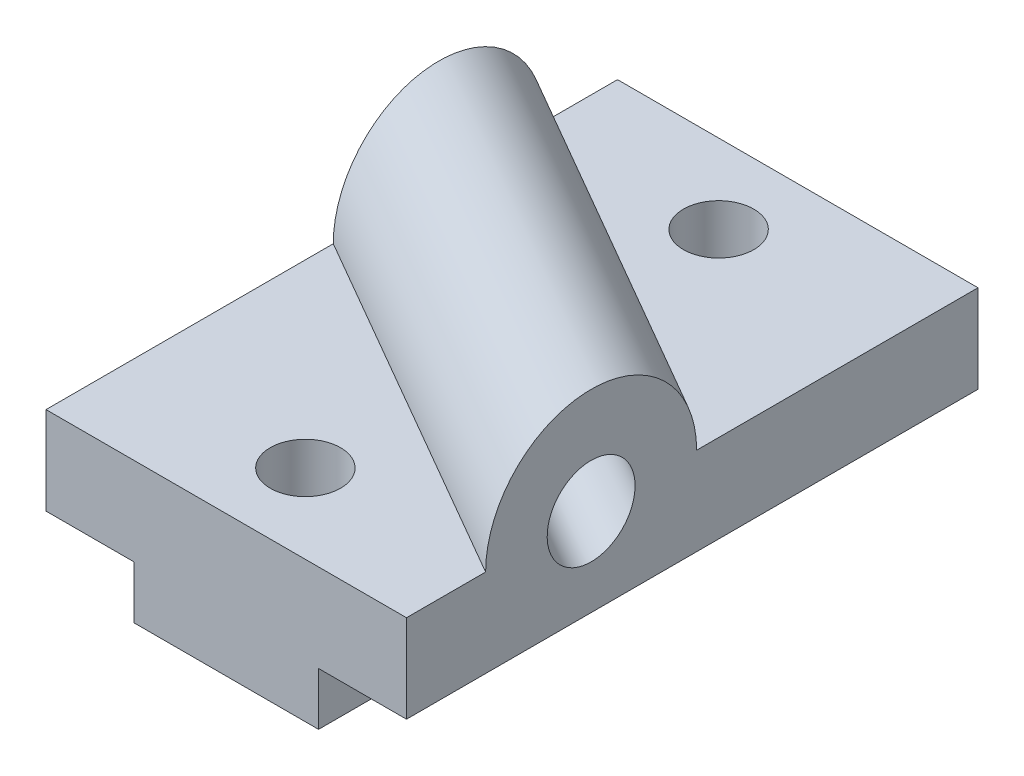
ISO-10303-21;
HEADER;
FILE_DESCRIPTION(('STEP AP214'),'2;1');
FILE_NAME('part.step','',(''),(''),'','','');
FILE_SCHEMA(('AUTOMOTIVE_DESIGN { 1 0 10303 214 1 1 1 1 }'));
ENDSEC;
DATA;
#1=APPLICATION_CONTEXT('core data for automotive mechanical design processes');
#2=APPLICATION_PROTOCOL_DEFINITION('international standard','automotive_design',2000,#1);
#3=PRODUCT_CONTEXT('',#1,'mechanical');
#4=PRODUCT('Part','Part','',(#3));
#5=PRODUCT_RELATED_PRODUCT_CATEGORY('part','',(#4));
#6=PRODUCT_DEFINITION_FORMATION('','',#4);
#7=PRODUCT_DEFINITION_CONTEXT('part definition',#1,'design');
#8=PRODUCT_DEFINITION('design','',#6,#7);
#9=PRODUCT_DEFINITION_SHAPE('','',#8);
#10=(LENGTH_UNIT() NAMED_UNIT(*) SI_UNIT(.MILLI.,.METRE.));
#11=(NAMED_UNIT(*) PLANE_ANGLE_UNIT() SI_UNIT($,.RADIAN.));
#12=(NAMED_UNIT(*) SI_UNIT($,.STERADIAN.) SOLID_ANGLE_UNIT());
#13=UNCERTAINTY_MEASURE_WITH_UNIT(LENGTH_MEASURE(1.E-05),#10,'distance_accuracy_value','');
#14=(GEOMETRIC_REPRESENTATION_CONTEXT(3) GLOBAL_UNCERTAINTY_ASSIGNED_CONTEXT((#13)) GLOBAL_UNIT_ASSIGNED_CONTEXT((#10,
#11,#12)) REPRESENTATION_CONTEXT('',''));
#15=CARTESIAN_POINT('',(0.,0.,0.));
#16=DIRECTION('',(0.,0.,1.));
#17=DIRECTION('',(1.,0.,0.));
#18=AXIS2_PLACEMENT_3D('',#15,#16,#17);
#19=CARTESIAN_POINT('',(-15.875,25.4,51.59375));
#20=DIRECTION('',(0.,-1.,0.));
#21=DIRECTION('',(1.,0.,0.));
#22=AXIS2_PLACEMENT_3D('',#19,#20,#21);
#23=PLANE('',#22);
#24=CARTESIAN_POINT('',(16.66875,25.4,37.30625));
#25=DIRECTION('',(0.,1.,0.));
#26=DIRECTION('',(-1.,0.,0.));
#27=AXIS2_PLACEMENT_3D('',#24,#25,#26);
#28=CIRCLE('',#27,6.35000000000001);
#29=CARTESIAN_POINT('',(10.31875,25.4,37.30625));
#30=VERTEX_POINT('',#29);
#31=EDGE_CURVE('E274',#30,#30,#28,.T.);
#32=ORIENTED_EDGE('',*,*,#31,.F.);
#33=EDGE_LOOP('',(#32));
#34=FACE_BOUND('',#33,.T.);
#35=DIRECTION('',(0.86602540378444,0.,0.499999999999998));
#36=VECTOR('',#35,1.);
#37=CARTESIAN_POINT('',(-55.6186306719983,25.4,-23.2180315129307));
#38=LINE('',#37,#36);
#39=CARTESIAN_POINT('',(-15.875,25.4,-0.27203564587952));
#40=VERTEX_POINT('',#39);
#41=CARTESIAN_POINT('',(49.2125,25.4,37.30625));
#42=VERTEX_POINT('',#41);
#43=EDGE_CURVE('E134',#40,#42,#38,.T.);
#44=ORIENTED_EDGE('',*,*,#43,.F.);
#45=DIRECTION('',(0.,0.,-1.));
#46=VECTOR('',#45,1.);
#47=CARTESIAN_POINT('',(-15.875,25.4,51.59375));
#48=LINE('',#47,#46);
#49=CARTESIAN_POINT('',(-15.875,25.4,51.59375));
#50=VERTEX_POINT('',#49);
#51=EDGE_CURVE('E132',#50,#40,#48,.T.);
#52=ORIENTED_EDGE('',*,*,#51,.F.);
#53=DIRECTION('',(-1.,0.,0.));
#54=VECTOR('',#53,1.);
#55=CARTESIAN_POINT('',(-15.875,25.4,51.59375));
#56=LINE('',#55,#54);
#57=CARTESIAN_POINT('',(49.2125,25.4,51.59375));
#58=VERTEX_POINT('',#57);
#59=EDGE_CURVE('E118',#58,#50,#56,.T.);
#60=ORIENTED_EDGE('',*,*,#59,.F.);
#61=DIRECTION('',(0.,0.,-1.));
#62=VECTOR('',#61,1.);
#63=CARTESIAN_POINT('',(49.2125,25.4,51.59375));
#64=LINE('',#63,#62);
#65=EDGE_CURVE('E168',#58,#42,#64,.T.);
#66=ORIENTED_EDGE('',*,*,#65,.T.);
#67=EDGE_LOOP('',(#44,#52,#60,#66));
#68=FACE_BOUND('',#67,.T.);
#69=ADVANCED_FACE('F33',(#34,#68),#23,.F.);
#70=CARTESIAN_POINT('',(16.66875,25.4,-37.30625));
#71=DIRECTION('',(0.,1.,0.));
#72=DIRECTION('',(-1.,0.,0.));
#73=AXIS2_PLACEMENT_3D('',#70,#71,#72);
#74=CIRCLE('',#73,6.35);
#75=CARTESIAN_POINT('',(10.31875,25.4,-37.30625));
#76=VERTEX_POINT('',#75);
#77=EDGE_CURVE('E271',#76,#76,#74,.T.);
#78=ORIENTED_EDGE('',*,*,#77,.F.);
#79=EDGE_LOOP('',(#78));
#80=FACE_BOUND('',#79,.T.);
#81=DIRECTION('',(0.86602540378444,0.,0.499999999999998));
#82=VECTOR('',#81,1.);
#83=CARTESIAN_POINT('',(-55.6186306719983,25.4,-61.3180315129307));
#84=LINE('',#83,#82);
#85=CARTESIAN_POINT('',(-15.875,25.4,-38.3720356458795));
#86=VERTEX_POINT('',#85);
#87=CARTESIAN_POINT('',(49.2125,25.4,-0.793749999999996));
#88=VERTEX_POINT('',#87);
#89=EDGE_CURVE('E53',#86,#88,#84,.T.);
#90=ORIENTED_EDGE('',*,*,#89,.T.);
#91=CARTESIAN_POINT('',(49.2125,25.4,-51.59375));
#92=VERTEX_POINT('',#91);
#93=EDGE_CURVE('E136',#88,#92,#64,.T.);
#94=ORIENTED_EDGE('',*,*,#93,.T.);
#95=DIRECTION('',(-1.,0.,0.));
#96=VECTOR('',#95,1.);
#97=CARTESIAN_POINT('',(-15.875,25.4,-51.59375));
#98=LINE('',#97,#96);
#99=CARTESIAN_POINT('',(-15.875,25.4,-51.59375));
#100=VERTEX_POINT('',#99);
#101=EDGE_CURVE('E159',#92,#100,#98,.T.);
#102=ORIENTED_EDGE('',*,*,#101,.T.);
#103=EDGE_CURVE('E137',#86,#100,#48,.T.);
#104=ORIENTED_EDGE('',*,*,#103,.F.);
#105=EDGE_LOOP('',(#90,#94,#102,#104));
#106=FACE_BOUND('',#105,.T.);
#107=ADVANCED_FACE('F235',(#80,#106),#23,.F.);
#108=CARTESIAN_POINT('',(0.,0.,51.59375));
#109=DIRECTION('',(1.,0.,0.));
#110=DIRECTION('',(0.,0.,-1.));
#111=AXIS2_PLACEMENT_3D('',#108,#109,#110);
#112=PLANE('',#111);
#113=DIRECTION('',(0.,-1.,0.));
#114=VECTOR('',#113,1.);
#115=CARTESIAN_POINT('',(0.,0.,-51.59375));
#116=LINE('',#115,#114);
#117=CARTESIAN_POINT('',(0.,9.525,-51.59375));
#118=VERTEX_POINT('',#117);
#119=CARTESIAN_POINT('',(0.,0.,-51.59375));
#120=VERTEX_POINT('',#119);
#121=EDGE_CURVE('E146',#118,#120,#116,.T.);
#122=ORIENTED_EDGE('',*,*,#121,.T.);
#123=DIRECTION('',(0.,0.,-1.));
#124=VECTOR('',#123,1.);
#125=CARTESIAN_POINT('',(0.,0.,51.59375));
#126=LINE('',#125,#124);
#127=CARTESIAN_POINT('',(0.,0.,51.59375));
#128=VERTEX_POINT('',#127);
#129=EDGE_CURVE('E11',#128,#120,#126,.T.);
#130=ORIENTED_EDGE('',*,*,#129,.F.);
#131=DIRECTION('',(0.,-1.,0.));
#132=VECTOR('',#131,1.);
#133=CARTESIAN_POINT('',(0.,0.,51.59375));
#134=LINE('',#133,#132);
#135=CARTESIAN_POINT('',(0.,9.525,51.59375));
#136=VERTEX_POINT('',#135);
#137=EDGE_CURVE('E165',#136,#128,#134,.T.);
#138=ORIENTED_EDGE('',*,*,#137,.F.);
#139=DIRECTION('',(0.,0.,-1.));
#140=VECTOR('',#139,1.);
#141=CARTESIAN_POINT('',(0.,9.525,51.59375));
#142=LINE('',#141,#140);
#143=EDGE_CURVE('E142',#136,#118,#142,.T.);
#144=ORIENTED_EDGE('',*,*,#143,.T.);
#145=EDGE_LOOP('',(#122,#130,#138,#144));
#146=FACE_BOUND('',#145,.T.);
#147=ADVANCED_FACE('F35',(#146),#112,.F.);
#148=CARTESIAN_POINT('',(0.,0.,51.59375));
#149=DIRECTION('',(0.,1.,0.));
#150=DIRECTION('',(-1.,0.,0.));
#151=AXIS2_PLACEMENT_3D('',#148,#149,#150);
#152=PLANE('',#151);
#153=CARTESIAN_POINT('',(16.66875,0.,-37.30625));
#154=DIRECTION('',(0.,1.,0.));
#155=DIRECTION('',(-1.,0.,0.));
#156=AXIS2_PLACEMENT_3D('',#153,#154,#155);
#157=CIRCLE('',#156,6.35);
#158=CARTESIAN_POINT('',(10.31875,0.,-37.30625));
#159=VERTEX_POINT('',#158);
#160=EDGE_CURVE('E253',#159,#159,#157,.T.);
#161=ORIENTED_EDGE('',*,*,#160,.T.);
#162=EDGE_LOOP('',(#161));
#163=FACE_BOUND('',#162,.T.);
#164=CARTESIAN_POINT('',(16.66875,0.,37.30625));
#165=DIRECTION('',(0.,1.,0.));
#166=DIRECTION('',(-1.,0.,0.));
#167=AXIS2_PLACEMENT_3D('',#164,#165,#166);
#168=CIRCLE('',#167,6.35000000000001);
#169=CARTESIAN_POINT('',(10.31875,0.,37.30625));
#170=VERTEX_POINT('',#169);
#171=EDGE_CURVE('E256',#170,#170,#168,.T.);
#172=ORIENTED_EDGE('',*,*,#171,.T.);
#173=EDGE_LOOP('',(#172));
#174=FACE_BOUND('',#173,.T.);
#175=DIRECTION('',(1.,0.,0.));
#176=VECTOR('',#175,1.);
#177=CARTESIAN_POINT('',(0.,0.,-51.59375));
#178=LINE('',#177,#176);
#179=CARTESIAN_POINT('',(33.3375,0.,-51.59375));
#180=VERTEX_POINT('',#179);
#181=EDGE_CURVE('E149',#120,#180,#178,.T.);
#182=ORIENTED_EDGE('',*,*,#181,.T.);
#183=DIRECTION('',(0.,0.,-1.));
#184=VECTOR('',#183,1.);
#185=CARTESIAN_POINT('',(33.3375,0.,51.59375));
#186=LINE('',#185,#184);
#187=CARTESIAN_POINT('',(33.3375,0.,51.59375));
#188=VERTEX_POINT('',#187);
#189=EDGE_CURVE('E46',#188,#180,#186,.T.);
#190=ORIENTED_EDGE('',*,*,#189,.F.);
#191=DIRECTION('',(1.,0.,0.));
#192=VECTOR('',#191,1.);
#193=CARTESIAN_POINT('',(0.,0.,51.59375));
#194=LINE('',#193,#192);
#195=EDGE_CURVE('E103',#128,#188,#194,.T.);
#196=ORIENTED_EDGE('',*,*,#195,.F.);
#197=ORIENTED_EDGE('',*,*,#129,.T.);
#198=EDGE_LOOP('',(#182,#190,#196,#197));
#199=FACE_BOUND('',#198,.T.);
#200=ADVANCED_FACE('F243',(#163,#174,#199),#152,.F.);
#201=CARTESIAN_POINT('',(33.3375,0.,51.59375));
#202=DIRECTION('',(-1.,0.,0.));
#203=DIRECTION('',(0.,0.,1.));
#204=AXIS2_PLACEMENT_3D('',#201,#202,#203);
#205=PLANE('',#204);
#206=DIRECTION('',(0.,1.,0.));
#207=VECTOR('',#206,1.);
#208=CARTESIAN_POINT('',(33.3375,0.,-51.59375));
#209=LINE('',#208,#207);
#210=CARTESIAN_POINT('',(33.3375,9.525,-51.59375));
#211=VERTEX_POINT('',#210);
#212=EDGE_CURVE('E152',#180,#211,#209,.T.);
#213=ORIENTED_EDGE('',*,*,#212,.T.);
#214=DIRECTION('',(0.,0.,-1.));
#215=VECTOR('',#214,1.);
#216=CARTESIAN_POINT('',(33.3375,9.525,51.59375));
#217=LINE('',#216,#215);
#218=CARTESIAN_POINT('',(33.3375,9.525,51.59375));
#219=VERTEX_POINT('',#218);
#220=EDGE_CURVE('E173',#219,#211,#217,.T.);
#221=ORIENTED_EDGE('',*,*,#220,.F.);
#222=DIRECTION('',(0.,1.,0.));
#223=VECTOR('',#222,1.);
#224=CARTESIAN_POINT('',(33.3375,0.,51.59375));
#225=LINE('',#224,#223);
#226=EDGE_CURVE('E182',#188,#219,#225,.T.);
#227=ORIENTED_EDGE('',*,*,#226,.F.);
#228=ORIENTED_EDGE('',*,*,#189,.T.);
#229=EDGE_LOOP('',(#213,#221,#227,#228));
#230=FACE_BOUND('',#229,.T.);
#231=ADVANCED_FACE('F180',(#230),#205,.F.);
#232=CARTESIAN_POINT('',(49.2125,9.525,51.59375));
#233=DIRECTION('',(0.,1.,0.));
#234=DIRECTION('',(-1.,0.,0.));
#235=AXIS2_PLACEMENT_3D('',#232,#233,#234);
#236=PLANE('',#235);
#237=DIRECTION('',(1.,0.,0.));
#238=VECTOR('',#237,1.);
#239=CARTESIAN_POINT('',(49.2125,9.525,-51.59375));
#240=LINE('',#239,#238);
#241=CARTESIAN_POINT('',(49.2125,9.525,-51.59375));
#242=VERTEX_POINT('',#241);
#243=EDGE_CURVE('E154',#211,#242,#240,.T.);
#244=ORIENTED_EDGE('',*,*,#243,.T.);
#245=DIRECTION('',(0.,0.,-1.));
#246=VECTOR('',#245,1.);
#247=CARTESIAN_POINT('',(49.2125,9.525,51.59375));
#248=LINE('',#247,#246);
#249=CARTESIAN_POINT('',(49.2125,9.525,51.59375));
#250=VERTEX_POINT('',#249);
#251=EDGE_CURVE('E170',#250,#242,#248,.T.);
#252=ORIENTED_EDGE('',*,*,#251,.F.);
#253=DIRECTION('',(1.,0.,0.));
#254=VECTOR('',#253,1.);
#255=CARTESIAN_POINT('',(49.2125,9.525,51.59375));
#256=LINE('',#255,#254);
#257=EDGE_CURVE('E197',#219,#250,#256,.T.);
#258=ORIENTED_EDGE('',*,*,#257,.F.);
#259=ORIENTED_EDGE('',*,*,#220,.T.);
#260=EDGE_LOOP('',(#244,#252,#258,#259));
#261=FACE_BOUND('',#260,.T.);
#262=ADVANCED_FACE('F191',(#261),#236,.F.);
#263=CARTESIAN_POINT('',(49.2125,25.4,51.59375));
#264=DIRECTION('',(-1.,0.,0.));
#265=DIRECTION('',(0.,-1.,0.));
#266=AXIS2_PLACEMENT_3D('',#263,#264,#265);
#267=PLANE('',#266);
#268=CARTESIAN_POINT('',(49.2125,25.4,18.25625));
#269=DIRECTION('',(1.,0.,0.));
#270=DIRECTION('',(0.,1.,0.));
#271=AXIS2_PLACEMENT_3D('',#268,#269,#270);
#272=CIRCLE('',#271,7.9375);
#273=CARTESIAN_POINT('',(49.2125,33.3375,18.25625));
#274=VERTEX_POINT('',#273);
#275=EDGE_CURVE('E278',#274,#274,#272,.T.);
#276=ORIENTED_EDGE('',*,*,#275,.F.);
#277=EDGE_LOOP('',(#276));
#278=FACE_BOUND('',#277,.T.);
#279=DIRECTION('',(0.,1.,0.));
#280=VECTOR('',#279,1.);
#281=CARTESIAN_POINT('',(49.2125,25.4,-51.59375));
#282=LINE('',#281,#280);
#283=EDGE_CURVE('E156',#242,#92,#282,.T.);
#284=ORIENTED_EDGE('',*,*,#283,.T.);
#285=ORIENTED_EDGE('',*,*,#93,.F.);
#286=CARTESIAN_POINT('',(49.2125,25.4,18.25625));
#287=DIRECTION('',(-1.,0.,0.));
#288=DIRECTION('',(0.,-1.,0.));
#289=AXIS2_PLACEMENT_3D('',#286,#287,#288);
#290=CIRCLE('',#289,19.05);
#291=EDGE_CURVE('E205',#42,#88,#290,.T.);
#292=ORIENTED_EDGE('',*,*,#291,.F.);
#293=ORIENTED_EDGE('',*,*,#65,.F.);
#294=DIRECTION('',(0.,1.,0.));
#295=VECTOR('',#294,1.);
#296=CARTESIAN_POINT('',(49.2125,25.4,51.59375));
#297=LINE('',#296,#295);
#298=EDGE_CURVE('E125',#250,#58,#297,.T.);
#299=ORIENTED_EDGE('',*,*,#298,.F.);
#300=ORIENTED_EDGE('',*,*,#251,.T.);
#301=EDGE_LOOP('',(#284,#285,#292,#293,#299,#300));
#302=FACE_BOUND('',#301,.T.);
#303=ADVANCED_FACE('F194',(#278,#302),#267,.F.);
#304=CARTESIAN_POINT('',(-15.875,9.525,51.59375));
#305=DIRECTION('',(1.,0.,0.));
#306=DIRECTION('',(0.,0.,-1.));
#307=AXIS2_PLACEMENT_3D('',#304,#305,#306);
#308=PLANE('',#307);
#309=CARTESIAN_POINT('',(-15.875,33.3375,-19.3220356458795));
#310=CARTESIAN_POINT('',(-15.875,33.3375053532936,-19.0723910889632));
#311=CARTESIAN_POINT('',(-15.875,33.3257194898455,-18.8228136758554));
#312=CARTESIAN_POINT('',(-15.875,33.2787048938766,-18.3260001169629));
#313=CARTESIAN_POINT('',(-15.875,33.2434918666413,-18.0787625151398));
#314=CARTESIAN_POINT('',(-15.875,33.1554834163424,-17.6176900107212));
#315=CARTESIAN_POINT('',(-15.875,33.1052564866072,-17.4033594674836));
#316=CARTESIAN_POINT('',(-15.875,32.9871757359532,-16.9795920515213));
#317=CARTESIAN_POINT('',(-15.875,32.9193213106122,-16.7701553468678));
#318=CARTESIAN_POINT('',(-15.875,32.7664704914981,-16.3576828620213));
#319=CARTESIAN_POINT('',(-15.875,32.6814774462789,-16.1546458404008));
#320=CARTESIAN_POINT('',(-15.875,32.4948946135662,-15.7562574449763));
#321=CARTESIAN_POINT('',(-15.875,32.393298925746,-15.5609088342538));
#322=CARTESIAN_POINT('',(-15.875,32.1742546464891,-15.179359977867));
#323=CARTESIAN_POINT('',(-15.875,32.0568089994728,-14.9931580417827));
#324=CARTESIAN_POINT('',(-15.875,31.8068596680208,-14.6311468480025));
#325=CARTESIAN_POINT('',(-15.875,31.6743557578099,-14.4553377461913));
#326=CARTESIAN_POINT('',(-15.875,31.3952092272094,-14.1153329242083));
#327=CARTESIAN_POINT('',(-15.875,31.2485668731155,-13.9511369854051));
#328=CARTESIAN_POINT('',(-15.875,30.9421507310453,-13.6354853481937));
#329=CARTESIAN_POINT('',(-15.875,30.7823766454864,-13.4840299386603));
#330=CARTESIAN_POINT('',(-15.875,30.45083338908,-13.1949356963916));
#331=CARTESIAN_POINT('',(-15.875,30.2790663771303,-13.0572943877389));
#332=CARTESIAN_POINT('',(-15.875,29.9246380901895,-12.7967039059166));
#333=CARTESIAN_POINT('',(-15.875,29.741973168748,-12.6737596922092));
#334=CARTESIAN_POINT('',(-15.875,29.3671288821207,-12.443506798931));
#335=CARTESIAN_POINT('',(-15.875,29.1749528459891,-12.336192699686));
#336=CARTESIAN_POINT('',(-15.875,28.7822841127163,-12.1378544522494));
#337=CARTESIAN_POINT('',(-15.875,28.5817884555569,-12.0468361641897));
#338=CARTESIAN_POINT('',(-15.875,28.1739686732671,-11.8817812771393));
#339=CARTESIAN_POINT('',(-15.875,27.9666458317772,-11.8077415064778));
#340=CARTESIAN_POINT('',(-15.875,27.546564867701,-11.6771322503721));
#341=CARTESIAN_POINT('',(-15.875,27.333806662786,-11.620563029722));
#342=CARTESIAN_POINT('',(-15.875,26.9043317058268,-11.5252880558879));
#343=CARTESIAN_POINT('',(-15.875,26.6876150290345,-11.486581963486));
#344=CARTESIAN_POINT('',(-15.875,26.2517110713016,-11.4272983301813));
#345=CARTESIAN_POINT('',(-15.875,26.0325237340797,-11.4067212031017));
#346=CARTESIAN_POINT('',(-15.875,25.5932368892746,-11.3838411901686));
#347=CARTESIAN_POINT('',(-15.875,25.3731375526176,-11.3815350223674));
#348=CARTESIAN_POINT('',(-15.875,24.9334332208621,-11.3952065443292));
#349=CARTESIAN_POINT('',(-15.875,24.7138284170291,-11.4111903867969));
#350=CARTESIAN_POINT('',(-15.875,24.27678107792,-11.4613327562854));
#351=CARTESIAN_POINT('',(-15.875,24.0593378176249,-11.4954849643221));
#352=CARTESIAN_POINT('',(-15.875,23.6279599191831,-11.5817398379609));
#353=CARTESIAN_POINT('',(-15.875,23.414026568255,-11.6338489414144));
#354=CARTESIAN_POINT('',(-15.875,22.9912663892337,-11.7556435291456));
#355=CARTESIAN_POINT('',(-15.875,22.7824386139157,-11.8253257255674));
#356=CARTESIAN_POINT('',(-15.875,22.3712873670937,-11.9817912054556));
#357=CARTESIAN_POINT('',(-15.875,22.1689639942162,-12.068574748088));
#358=CARTESIAN_POINT('',(-15.875,21.7722261928293,-12.2586409898234));
#359=CARTESIAN_POINT('',(-15.875,21.5778116141972,-12.3619233755659));
#360=CARTESIAN_POINT('',(-15.875,21.1982258105654,-12.5842776586956));
#361=CARTESIAN_POINT('',(-15.875,21.013054796656,-12.7033499164409));
#362=CARTESIAN_POINT('',(-15.875,20.6532723189666,-12.9564368496797));
#363=CARTESIAN_POINT('',(-15.875,20.478658964345,-13.0904488372184));
#364=CARTESIAN_POINT('',(-15.875,20.141104485662,-13.3725548169441));
#365=CARTESIAN_POINT('',(-15.875,19.9781673090277,-13.5206535324916));
#366=CARTESIAN_POINT('',(-15.875,19.6652102609166,-13.8298177593128));
#367=CARTESIAN_POINT('',(-15.875,19.5151859193542,-13.9908787457228));
#368=CARTESIAN_POINT('',(-15.875,19.2289755748308,-14.3249602225451));
#369=CARTESIAN_POINT('',(-15.875,19.0927945577464,-14.4979849844537));
#370=CARTESIAN_POINT('',(-15.875,18.8352972890965,-14.8547136692958));
#371=CARTESIAN_POINT('',(-15.875,18.7139782713142,-15.0384155955086));
#372=CARTESIAN_POINT('',(-15.875,18.4870117792713,-15.4152617255099));
#373=CARTESIAN_POINT('',(-15.875,18.3813645252907,-15.6084060619687));
#374=CARTESIAN_POINT('',(-15.875,18.1864751723777,-16.0027968157821));
#375=CARTESIAN_POINT('',(-15.875,18.0972327687776,-16.2040430825845));
#376=CARTESIAN_POINT('',(-15.875,17.9357652261877,-16.613255793562));
#377=CARTESIAN_POINT('',(-15.875,17.8635404802334,-16.821222392822));
#378=CARTESIAN_POINT('',(-15.875,17.7366236600216,-17.2423887867763));
#379=CARTESIAN_POINT('',(-15.875,17.6819277633563,-17.4555874296197));
#380=CARTESIAN_POINT('',(-15.875,17.5904058382747,-17.8858786436482));
#381=CARTESIAN_POINT('',(-15.875,17.5535872070044,-18.1029727882298));
#382=CARTESIAN_POINT('',(-15.875,17.4981079864208,-18.5394689875572));
#383=CARTESIAN_POINT('',(-15.875,17.4794473971075,-18.758871042303));
#384=CARTESIAN_POINT('',(-15.875,17.4604171208355,-19.1983760368432));
#385=CARTESIAN_POINT('',(-15.875,17.4600398783264,-19.4184786495273));
#386=CARTESIAN_POINT('',(-15.875,17.4775617641373,-19.8580033862223));
#387=CARTESIAN_POINT('',(-15.875,17.495464881477,-20.0774253512245));
#388=CARTESIAN_POINT('',(-15.875,17.5494292696524,-20.5140197338549));
#389=CARTESIAN_POINT('',(-15.875,17.5854901211532,-20.7311922033148));
#390=CARTESIAN_POINT('',(-15.875,17.6755215253675,-21.1617967467504));
#391=CARTESIAN_POINT('',(-15.875,17.7294924107239,-21.3752287511771));
#392=CARTESIAN_POINT('',(-15.875,17.854970020383,-21.7968709735428));
#393=CARTESIAN_POINT('',(-15.875,17.9264764982209,-22.0050812648283));
#394=CARTESIAN_POINT('',(-15.875,18.0865467388552,-22.4148833097408));
#395=CARTESIAN_POINT('',(-15.875,18.1751136794166,-22.6164738221348));
#396=CARTESIAN_POINT('',(-15.875,18.3686494942014,-23.0115316443122));
#397=CARTESIAN_POINT('',(-15.875,18.4736124725154,-23.2050018425031));
#398=CARTESIAN_POINT('',(-15.875,18.6992778881036,-23.5826256676463));
#399=CARTESIAN_POINT('',(-15.875,18.8199857852789,-23.7667760318488));
#400=CARTESIAN_POINT('',(-15.875,19.0762354610433,-24.1243552727823));
#401=CARTESIAN_POINT('',(-15.875,19.2117722361151,-24.2977877351975));
#402=CARTESIAN_POINT('',(-15.875,19.4968025945144,-24.6328311977801));
#403=CARTESIAN_POINT('',(-15.875,19.6462986809849,-24.7944400684736));
#404=CARTESIAN_POINT('',(-15.875,19.9581908206265,-25.1046820752597));
#405=CARTESIAN_POINT('',(-15.875,20.1205865792716,-25.2533155074458));
#406=CARTESIAN_POINT('',(-15.875,20.4571625717262,-25.53658686251));
#407=CARTESIAN_POINT('',(-15.875,20.631343029276,-25.6712245195462));
#408=CARTESIAN_POINT('',(-15.875,20.9902797885073,-25.9255691617787));
#409=CARTESIAN_POINT('',(-15.875,21.175035929865,-26.0452763732283));
#410=CARTESIAN_POINT('',(-15.875,21.5538858195474,-26.2689566174488));
#411=CARTESIAN_POINT('',(-15.875,21.747981307473,-26.3729267038627));
#412=CARTESIAN_POINT('',(-15.875,22.1440655684463,-26.5643530675115));
#413=CARTESIAN_POINT('',(-15.875,22.3460514847024,-26.6518152558886));
#414=CARTESIAN_POINT('',(-15.875,22.7566588710073,-26.8096956161372));
#415=CARTESIAN_POINT('',(-15.875,22.9652826237873,-26.8801078513134));
#416=CARTESIAN_POINT('',(-15.875,23.38758611426,-27.0033416608461));
#417=CARTESIAN_POINT('',(-15.875,23.6012641276001,-27.05616914443));
#418=CARTESIAN_POINT('',(-15.875,24.0323071830721,-27.1439091657431));
#419=CARTESIAN_POINT('',(-15.875,24.2496728807287,-27.1788184831178));
#420=CARTESIAN_POINT('',(-15.875,24.6865473859011,-27.2304660994757));
#421=CARTESIAN_POINT('',(-15.875,24.9060561443861,-27.2472048132034));
#422=CARTESIAN_POINT('',(-15.875,25.3457097027759,-27.2623971760672));
#423=CARTESIAN_POINT('',(-15.875,25.5658545146806,-27.260850477946));
#424=CARTESIAN_POINT('',(-15.875,26.0052520379962,-27.2394820277446));
#425=CARTESIAN_POINT('',(-15.875,26.2245047628769,-27.2196605526349));
#426=CARTESIAN_POINT('',(-15.875,26.6606479206905,-27.1618744257506));
#427=CARTESIAN_POINT('',(-15.875,26.8775379042265,-27.1239063820338));
#428=CARTESIAN_POINT('',(-15.875,27.3073379599264,-27.0301049608818));
#429=CARTESIAN_POINT('',(-15.875,27.5202494320148,-26.9742779977332));
#430=CARTESIAN_POINT('',(-15.875,27.9407755912752,-26.8451176970842));
#431=CARTESIAN_POINT('',(-15.875,28.1483884110404,-26.7717782794478));
#432=CARTESIAN_POINT('',(-15.875,28.5567370031874,-26.6081377063798));
#433=CARTESIAN_POINT('',(-15.875,28.7574750654001,-26.5178422648901));
#434=CARTESIAN_POINT('',(-15.875,29.1507968239369,-26.3208792778898));
#435=CARTESIAN_POINT('',(-15.875,29.3433790488731,-26.2142087940897));
#436=CARTESIAN_POINT('',(-15.875,29.7190162479378,-25.9852469982759));
#437=CARTESIAN_POINT('',(-15.875,29.9020714391305,-25.8629560423792));
#438=CARTESIAN_POINT('',(-15.875,30.2573983078667,-25.6035936001145));
#439=CARTESIAN_POINT('',(-15.875,30.429669780914,-25.4665218335863));
#440=CARTESIAN_POINT('',(-15.875,30.7622329484895,-25.1785486941881));
#441=CARTESIAN_POINT('',(-15.875,30.9225248241185,-25.02764753046));
#442=CARTESIAN_POINT('',(-15.875,31.2300532777732,-24.7130266397509));
#443=CARTESIAN_POINT('',(-15.875,31.3772874131264,-24.5493045251337));
#444=CARTESIAN_POINT('',(-15.875,31.6575991035606,-24.2102586938501));
#445=CARTESIAN_POINT('',(-15.875,31.7906817100867,-24.034939153425));
#446=CARTESIAN_POINT('',(-15.875,32.04186322303,-23.6738107078445));
#447=CARTESIAN_POINT('',(-15.875,32.15995839347,-23.4879992039298));
#448=CARTESIAN_POINT('',(-15.875,32.3802946333826,-23.1072400371243));
#449=CARTESIAN_POINT('',(-15.875,32.4825379082308,-22.9122936500362));
#450=CARTESIAN_POINT('',(-15.875,32.6704654081358,-22.5146178144217));
#451=CARTESIAN_POINT('',(-15.875,32.7561531946992,-22.3118900511406));
#452=CARTESIAN_POINT('',(-15.875,32.9104434180221,-21.8999393363339));
#453=CARTESIAN_POINT('',(-15.875,32.9790360861957,-21.6907127476529));
#454=CARTESIAN_POINT('',(-15.875,33.1377067201341,-21.1287140920005));
#455=CARTESIAN_POINT('',(-15.875,33.2125197270566,-20.7715112041684));
#456=CARTESIAN_POINT('',(-15.875,33.3124170635124,-20.0501706919033));
#457=CARTESIAN_POINT('',(-15.875,33.3374921945894,-19.6860317973038));
#458=CARTESIAN_POINT('',(-15.875,33.3375,-19.3220356458795));
#459=B_SPLINE_CURVE_WITH_KNOTS('',3,(#309,#310,#311,#312,#313,#314,#315,#316,#317,#318,#319,
#320,#321,#322,#323,#324,#325,#326,#327,#328,#329,#330,#331,#332,#333,#334,#335,#336,#337,#338,
#339,#340,#341,#342,#343,#344,#345,#346,#347,#348,#349,#350,#351,#352,#353,#354,#355,#356,#357,
#358,#359,#360,#361,#362,#363,#364,#365,#366,#367,#368,#369,#370,#371,#372,#373,#374,#375,#376,
#377,#378,#379,#380,#381,#382,#383,#384,#385,#386,#387,#388,#389,#390,#391,#392,#393,#394,#395,
#396,#397,#398,#399,#400,#401,#402,#403,#404,#405,#406,#407,#408,#409,#410,#411,#412,#413,#414,
#415,#416,#417,#418,#419,#420,#421,#422,#423,#424,#425,#426,#427,#428,#429,#430,#431,#432,#433,
#434,#435,#436,#437,#438,#439,#440,#441,#442,#443,#444,#445,#446,#447,#448,#449,#450,#451,#452,
#453,#454,#455,#456,#457,#458),.UNSPECIFIED.,.T.,.F.,(4,2,2,2,2,2,2,2,2,2,2,2,2,2,2,2,2,2,2,2,2,
2,2,2,2,2,2,2,2,2,2,2,2,2,2,2,2,2,2,2,2,2,2,2,2,2,2,2,2,2,2,2,2,2,2,2,2,2,2,2,2,2,2,2,2,2,2,2,2,
2,2,2,2,2,4),(0.,0.748544559333572,1.49658780847589,2.15626188452582,2.81595858286499,
3.47552651393641,4.13532935721831,4.79500979831742,5.45470013160791,6.11437804214814,
6.77407090599719,7.43364532037936,8.09344168035438,8.75300871134376,9.41281245470712,
10.0724928428893,10.7321832290965,11.391861087377,12.0515540034857,12.7111284186106,
13.3709247778428,14.0304918088208,14.6902955521955,15.349975940372,16.0096663265849,
16.6693441848682,17.3290371009742,17.9886115161617,18.6484078753314,19.307974903859,
19.9677786496842,20.6274594011325,21.2871494240738,21.9468271941398,22.606520198463,
23.2660692495769,23.9258909728037,24.5857126960305,25.2452617471443,25.9049547514675,
26.5646325215336,27.2243225444748,27.884003295923,28.5438070417481,29.2033740702757,
29.8631704294454,30.5227448446329,31.182437760739,31.8421156190222,32.5018060052351,
33.1614863934118,33.8212901367865,34.4808571677645,35.1406535269967,35.8002279421216,
36.4599208582307,37.1195987165108,37.7792891027185,38.4389694909001,39.0987732342731,
39.7583402652528,40.4181366246278,41.0777110396099,41.7374039453333,42.3970818139992,
43.0567721886158,43.7164525883888,44.3762561334519,45.0358233627417,45.6955546833509,
46.3551941371257,47.0146915272857,47.6745649114227,48.7657842289939,49.8572053363979),.UNSPECIFIED.);
#460=CARTESIAN_POINT('',(-15.875,33.3375,-19.3220356458795));
#461=VERTEX_POINT('',#460);
#462=EDGE_CURVE('E37',#461,#461,#459,.T.);
#463=ORIENTED_EDGE('',*,*,#462,.T.);
#464=EDGE_LOOP('',(#463));
#465=FACE_BOUND('',#464,.T.);
#466=DIRECTION('',(0.,-1.,0.));
#467=VECTOR('',#466,1.);
#468=CARTESIAN_POINT('',(-15.875,9.525,-51.59375));
#469=LINE('',#468,#467);
#470=CARTESIAN_POINT('',(-15.875,9.525,-51.59375));
#471=VERTEX_POINT('',#470);
#472=EDGE_CURVE('E162',#100,#471,#469,.T.);
#473=ORIENTED_EDGE('',*,*,#472,.T.);
#474=DIRECTION('',(0.,0.,-1.));
#475=VECTOR('',#474,1.);
#476=CARTESIAN_POINT('',(-15.875,9.525,51.59375));
#477=LINE('',#476,#475);
#478=CARTESIAN_POINT('',(-15.875,9.525,51.59375));
#479=VERTEX_POINT('',#478);
#480=EDGE_CURVE('E140',#479,#471,#477,.T.);
#481=ORIENTED_EDGE('',*,*,#480,.F.);
#482=DIRECTION('',(0.,-1.,0.));
#483=VECTOR('',#482,1.);
#484=CARTESIAN_POINT('',(-15.875,9.525,51.59375));
#485=LINE('',#484,#483);
#486=EDGE_CURVE('E122',#50,#479,#485,.T.);
#487=ORIENTED_EDGE('',*,*,#486,.F.);
#488=ORIENTED_EDGE('',*,*,#51,.T.);
#489=CARTESIAN_POINT('',(-15.875,25.4,-38.3720356458795));
#490=CARTESIAN_POINT('',(-15.875,25.6995097664235,-38.3720352313106));
#491=CARTESIAN_POINT('',(-15.875,25.9989732139466,-38.3649708036127));
#492=CARTESIAN_POINT('',(-15.875,26.5972367148659,-38.336736120068));
#493=CARTESIAN_POINT('',(-15.875,26.8960367630236,-38.31556575323));
#494=CARTESIAN_POINT('',(-15.875,27.7902051359447,-38.2309645423505));
#495=CARTESIAN_POINT('',(-15.875,28.3837182401478,-38.146443520635));
#496=CARTESIAN_POINT('',(-15.875,29.4904919403846,-37.9351828799095));
#497=CARTESIAN_POINT('',(-15.875,30.0049442576948,-37.8146164449992));
#498=CARTESIAN_POINT('',(-15.875,30.7676501065266,-37.6020935311112));
#499=CARTESIAN_POINT('',(-15.875,31.0203928020828,-37.5259726270335));
#500=CARTESIAN_POINT('',(-15.875,31.522560524903,-37.3632783051654));
#501=CARTESIAN_POINT('',(-15.875,31.7719846873965,-37.2767022198925));
#502=CARTESIAN_POINT('',(-15.875,32.5144610733894,-37.0015561919793));
#503=CARTESIAN_POINT('',(-15.875,33.0018754468322,-36.7975243615022));
#504=CARTESIAN_POINT('',(-15.875,33.9580703250295,-36.3496794351639));
#505=CARTESIAN_POINT('',(-15.875,34.4268508645839,-36.1058664136008));
#506=CARTESIAN_POINT('',(-15.875,35.1135617517577,-35.711634757618));
#507=CARTESIAN_POINT('',(-15.875,35.3397596623208,-35.5754462292981));
#508=CARTESIAN_POINT('',(-15.875,35.7862454028067,-35.2938251098535));
#509=CARTESIAN_POINT('',(-15.875,36.0065346879763,-35.148394825188));
#510=CARTESIAN_POINT('',(-15.875,36.6580813296923,-34.6985302499483));
#511=CARTESIAN_POINT('',(-15.875,37.080063156379,-34.3804960043378));
#512=CARTESIAN_POINT('',(-15.875,37.8961071184453,-33.7105240401054));
#513=CARTESIAN_POINT('',(-15.875,38.2901691785344,-33.3585862300629));
#514=CARTESIAN_POINT('',(-15.875,39.0477236577904,-32.6231924236468));
#515=CARTESIAN_POINT('',(-15.875,39.4112160023652,-32.2397363503713));
#516=CARTESIAN_POINT('',(-15.875,40.1050995713011,-31.4439679233941));
#517=CARTESIAN_POINT('',(-15.875,40.4354908240093,-31.0316555944049));
#518=CARTESIAN_POINT('',(-15.875,41.0608954219497,-30.1810193634878));
#519=CARTESIAN_POINT('',(-15.875,41.3559087929088,-29.7426954804759));
#520=CARTESIAN_POINT('',(-15.875,41.9085188530965,-28.8430642457484));
#521=CARTESIAN_POINT('',(-15.875,42.1661155326377,-28.3817568880823));
#522=CARTESIAN_POINT('',(-15.875,42.6421132526185,-27.4393448481326));
#523=CARTESIAN_POINT('',(-15.875,42.8605142848505,-26.9582401617035));
#524=CARTESIAN_POINT('',(-15.875,43.2566119746884,-25.9795567734205));
#525=CARTESIAN_POINT('',(-15.875,43.4343086353423,-25.4819780728003));
#526=CARTESIAN_POINT('',(-15.875,43.7477702219999,-24.4737835443778));
#527=CARTESIAN_POINT('',(-15.875,43.8835351505039,-23.9631677173529));
#528=CARTESIAN_POINT('',(-15.875,44.1121955176402,-22.9324258620135));
#529=CARTESIAN_POINT('',(-15.875,44.2050909554593,-22.4122998335186));
#530=CARTESIAN_POINT('',(-15.875,44.3473706873321,-21.3661302214724));
#531=CARTESIAN_POINT('',(-15.875,44.3967549804423,-20.8400866377928));
#532=CARTESIAN_POINT('',(-15.875,44.4516713084149,-19.7857154483492));
#533=CARTESIAN_POINT('',(-15.875,44.4572033431134,-19.2573878425767));
#534=CARTESIAN_POINT('',(-15.875,44.4243769436824,-18.2020979265927));
#535=CARTESIAN_POINT('',(-15.875,44.3860185108328,-17.6751356163415));
#536=CARTESIAN_POINT('',(-15.875,44.2656761307441,-16.6262161633126));
#537=CARTESIAN_POINT('',(-15.875,44.1836921851193,-16.1042590203498));
#538=CARTESIAN_POINT('',(-15.875,43.9766650613829,-15.0689551309097));
#539=CARTESIAN_POINT('',(-15.875,43.851621878829,-14.5556083853208));
#540=CARTESIAN_POINT('',(-15.875,43.559339943053,-13.5410710735395));
#541=CARTESIAN_POINT('',(-15.875,43.3921011834902,-13.039880509174));
#542=CARTESIAN_POINT('',(-15.875,43.0165834343606,-12.0531177702182));
#543=CARTESIAN_POINT('',(-15.875,42.8083044613623,-11.5675455893227));
#544=CARTESIAN_POINT('',(-15.875,42.3521446669318,-10.6153733824461));
#545=CARTESIAN_POINT('',(-15.875,42.1042638681537,-10.1487733456122));
#546=CARTESIAN_POINT('',(-15.875,41.5706133850158,-9.23776836446995));
#547=CARTESIAN_POINT('',(-15.875,41.2848436420119,-8.79336345451629));
#548=CARTESIAN_POINT('',(-15.875,40.6773840182908,-7.92981444195883));
#549=CARTESIAN_POINT('',(-15.875,40.3556940616741,-7.51067039273418));
#550=CARTESIAN_POINT('',(-15.875,39.6786363684042,-6.70055570439683));
#551=CARTESIAN_POINT('',(-15.875,39.323268826213,-6.30958490262842));
#552=CARTESIAN_POINT('',(-15.875,38.581245015274,-5.55846485085773));
#553=CARTESIAN_POINT('',(-15.875,38.1945889838937,-5.19831536707468));
#554=CARTESIAN_POINT('',(-15.875,37.5933039030993,-4.68319818532377));
#555=CARTESIAN_POINT('',(-15.875,37.3893132068278,-4.51566818313567));
#556=CARTESIAN_POINT('',(-15.875,36.9744983433124,-4.1891849285557));
#557=CARTESIAN_POINT('',(-15.875,36.7636724993291,-4.03023380653632));
#558=CARTESIAN_POINT('',(-15.875,36.1216287692128,-3.56679326607601));
#559=CARTESIAN_POINT('',(-15.875,35.6807019041117,-3.27559438118436));
#560=CARTESIAN_POINT('',(-15.875,34.7762399570041,-2.73085082240133));
#561=CARTESIAN_POINT('',(-15.875,34.3127046489182,-2.47730652514995));
#562=CARTESIAN_POINT('',(-15.875,33.3662325732845,-2.00960624513387));
#563=CARTESIAN_POINT('',(-15.875,32.8832983479004,-1.79544512171996));
#564=CARTESIAN_POINT('',(-15.875,31.9011797102467,-1.40790984753165));
#565=CARTESIAN_POINT('',(-15.875,31.4019912452066,-1.23454595901775));
#566=CARTESIAN_POINT('',(-15.875,30.4522495522043,-0.948342673957407));
#567=CARTESIAN_POINT('',(-15.875,30.0031318017581,-0.830715025976902));
#568=CARTESIAN_POINT('',(-15.875,29.0973694998249,-0.628524974518004));
#569=CARTESIAN_POINT('',(-15.875,28.6407228850689,-0.543971797437193));
#570=CARTESIAN_POINT('',(-15.875,27.7212681045421,-0.408266727688176));
#571=CARTESIAN_POINT('',(-15.875,27.2584468868161,-0.357203316163172));
#572=CARTESIAN_POINT('',(-15.875,26.3304184558527,-0.28907554027325));
#573=CARTESIAN_POINT('',(-15.875,25.8652118265964,-0.272003218804413));
#574=CARTESIAN_POINT('',(-15.875,25.4,-0.272035645879517));
#575=B_SPLINE_CURVE_WITH_KNOTS('',3,(#489,#490,#491,#492,#493,#494,#495,#496,#497,#498,#499,
#500,#501,#502,#503,#504,#505,#506,#507,#508,#509,#510,#511,#512,#513,#514,#515,#516,#517,#518,
#519,#520,#521,#522,#523,#524,#525,#526,#527,#528,#529,#530,#531,#532,#533,#534,#535,#536,#537,
#538,#539,#540,#541,#542,#543,#544,#545,#546,#547,#548,#549,#550,#551,#552,#553,#554,#555,#556,
#557,#558,#559,#560,#561,#562,#563,#564,#565,#566,#567,#568,#569,#570,#571,#572,#573,#574),
.UNSPECIFIED.,.F.,.F.,(4,2,2,2,2,2,2,2,2,2,2,2,2,2,2,2,2,2,2,2,2,2,2,2,2,2,2,2,2,2,2,2,2,2,2,2,
2,2,2,2,2,2,4),(0.,0.898353547211147,1.79671416310304,3.59231026588269,5.17560679591683,
5.96727324091003,6.75914209613896,8.34238850388003,9.92563195467384,10.7175269555399,
11.509225093999,13.0924638224091,14.6757068201284,16.2589536809436,17.8421991858843,
19.4254435394782,21.0086883029816,22.5919333980128,24.1751783744845,25.7584232565473,
27.3416681686473,28.9249131150818,30.5081580674347,32.0914029736164,33.6746478212125,
35.2578928321509,36.8411380810047,38.4243826906854,40.0076263946789,41.59087254922,
43.1741220492278,44.7573624077545,46.3405907562838,47.1322946663606,47.9241942822197,
49.507431293857,51.0906841407546,52.6737301802083,54.2571739992464,55.6487641930888,
57.0407423061732,58.4363834158348,59.8316977761145),.UNSPECIFIED.);
#576=EDGE_CURVE('E150',#86,#40,#575,.T.);
#577=ORIENTED_EDGE('',*,*,#576,.F.);
#578=ORIENTED_EDGE('',*,*,#103,.T.);
#579=EDGE_LOOP('',(#473,#481,#487,#488,#577,#578));
#580=FACE_BOUND('',#579,.T.);
#581=ADVANCED_FACE('F139',(#465,#580),#308,.F.);
#582=CARTESIAN_POINT('',(0.,9.525,51.59375));
#583=DIRECTION('',(0.,1.,0.));
#584=DIRECTION('',(-1.,0.,0.));
#585=AXIS2_PLACEMENT_3D('',#582,#583,#584);
#586=PLANE('',#585);
#587=DIRECTION('',(1.,0.,0.));
#588=VECTOR('',#587,1.);
#589=CARTESIAN_POINT('',(0.,9.525,-51.59375));
#590=LINE('',#589,#588);
#591=EDGE_CURVE('E95',#471,#118,#590,.T.);
#592=ORIENTED_EDGE('',*,*,#591,.T.);
#593=ORIENTED_EDGE('',*,*,#143,.F.);
#594=DIRECTION('',(1.,0.,0.));
#595=VECTOR('',#594,1.);
#596=CARTESIAN_POINT('',(0.,9.525,51.59375));
#597=LINE('',#596,#595);
#598=EDGE_CURVE('E62',#479,#136,#597,.T.);
#599=ORIENTED_EDGE('',*,*,#598,.F.);
#600=ORIENTED_EDGE('',*,*,#480,.T.);
#601=EDGE_LOOP('',(#592,#593,#599,#600));
#602=FACE_BOUND('',#601,.T.);
#603=ADVANCED_FACE('F224',(#602),#586,.F.);
#604=CARTESIAN_POINT('',(0.,0.,51.59375));
#605=DIRECTION('',(0.,0.,1.));
#606=DIRECTION('',(1.,0.,0.));
#607=AXIS2_PLACEMENT_3D('',#604,#605,#606);
#608=PLANE('',#607);
#609=ORIENTED_EDGE('',*,*,#137,.T.);
#610=ORIENTED_EDGE('',*,*,#195,.T.);
#611=ORIENTED_EDGE('',*,*,#226,.T.);
#612=ORIENTED_EDGE('',*,*,#257,.T.);
#613=ORIENTED_EDGE('',*,*,#298,.T.);
#614=ORIENTED_EDGE('',*,*,#59,.T.);
#615=ORIENTED_EDGE('',*,*,#486,.T.);
#616=ORIENTED_EDGE('',*,*,#598,.T.);
#617=EDGE_LOOP('',(#609,#610,#611,#612,#613,#614,#615,#616));
#618=FACE_BOUND('',#617,.T.);
#619=ADVANCED_FACE('F120',(#618),#608,.T.);
#620=CARTESIAN_POINT('',(0.,0.,-51.59375));
#621=DIRECTION('',(0.,0.,1.));
#622=DIRECTION('',(1.,0.,0.));
#623=AXIS2_PLACEMENT_3D('',#620,#621,#622);
#624=PLANE('',#623);
#625=ORIENTED_EDGE('',*,*,#121,.F.);
#626=ORIENTED_EDGE('',*,*,#591,.F.);
#627=ORIENTED_EDGE('',*,*,#472,.F.);
#628=ORIENTED_EDGE('',*,*,#101,.F.);
#629=ORIENTED_EDGE('',*,*,#283,.F.);
#630=ORIENTED_EDGE('',*,*,#243,.F.);
#631=ORIENTED_EDGE('',*,*,#212,.F.);
#632=ORIENTED_EDGE('',*,*,#181,.F.);
#633=EDGE_LOOP('',(#625,#626,#627,#628,#629,#630,#631,#632));
#634=FACE_BOUND('',#633,.T.);
#635=ADVANCED_FACE('F186',(#634),#624,.F.);
#636=CARTESIAN_POINT('',(-55.6186306719983,25.4,-42.2680315129307));
#637=DIRECTION('',(-1.,0.,0.));
#638=DIRECTION('',(0.,-1.,0.));
#639=AXIS2_PLACEMENT_3D('',#636,#637,#638);
#640=CIRCLE('',#639,19.05);
#641=DIRECTION('',(0.86602540378444,0.,0.499999999999998));
#642=VECTOR('',#641,1.);
#643=SURFACE_OF_LINEAR_EXTRUSION('',#640,#642);
#644=ORIENTED_EDGE('',*,*,#89,.F.);
#645=ORIENTED_EDGE('',*,*,#576,.T.);
#646=ORIENTED_EDGE('',*,*,#43,.T.);
#647=ORIENTED_EDGE('',*,*,#291,.T.);
#648=EDGE_LOOP('',(#644,#645,#646,#647));
#649=FACE_BOUND('',#648,.T.);
#650=ADVANCED_FACE('F214',(#649),#643,.F.);
#651=CARTESIAN_POINT('',(-33.2861005484411,25.4,-29.3743392344096));
#652=DIRECTION('',(1.,0.,0.));
#653=DIRECTION('',(0.,1.,0.));
#654=AXIS2_PLACEMENT_3D('',#651,#652,#653);
#655=CIRCLE('',#654,7.9375);
#656=DIRECTION('',(0.86602540378444,0.,0.499999999999998));
#657=VECTOR('',#656,1.);
#658=SURFACE_OF_LINEAR_EXTRUSION('',#655,#657);
#659=ORIENTED_EDGE('',*,*,#275,.T.);
#660=EDGE_LOOP('',(#659));
#661=FACE_BOUND('',#660,.T.);
#662=ORIENTED_EDGE('',*,*,#462,.F.);
#663=EDGE_LOOP('',(#662));
#664=FACE_BOUND('',#663,.T.);
#665=ADVANCED_FACE('F218',(#661,#664),#658,.F.);
#666=CARTESIAN_POINT('',(16.66875,0.,37.30625));
#667=DIRECTION('',(0.,1.,0.));
#668=DIRECTION('',(-1.,0.,0.));
#669=AXIS2_PLACEMENT_3D('',#666,#667,#668);
#670=CYLINDRICAL_SURFACE('',#669,6.35000000000001);
#671=CARTESIAN_POINT('',(10.31875,0.,37.30625));
#672=CARTESIAN_POINT('',(10.31875,0.26458333333333,37.30625));
#673=CARTESIAN_POINT('',(10.31875,0.529166666666663,37.30625));
#674=CARTESIAN_POINT('',(10.31875,1.05833333333333,37.30625));
#675=CARTESIAN_POINT('',(10.31875,1.32291666666666,37.30625));
#676=CARTESIAN_POINT('',(10.31875,1.85208333333333,37.30625));
#677=CARTESIAN_POINT('',(10.31875,2.11666666666666,37.30625));
#678=CARTESIAN_POINT('',(10.31875,2.64583333333333,37.30625));
#679=CARTESIAN_POINT('',(10.31875,2.91041666666666,37.30625));
#680=CARTESIAN_POINT('',(10.31875,3.43958333333333,37.30625));
#681=CARTESIAN_POINT('',(10.31875,3.70416666666666,37.30625));
#682=CARTESIAN_POINT('',(10.31875,4.23333333333333,37.30625));
#683=CARTESIAN_POINT('',(10.31875,4.49791666666666,37.30625));
#684=CARTESIAN_POINT('',(10.31875,5.02708333333333,37.30625));
#685=CARTESIAN_POINT('',(10.31875,5.29166666666666,37.30625));
#686=CARTESIAN_POINT('',(10.31875,5.82083333333333,37.30625));
#687=CARTESIAN_POINT('',(10.31875,6.08541666666666,37.30625));
#688=CARTESIAN_POINT('',(10.31875,6.61458333333333,37.30625));
#689=CARTESIAN_POINT('',(10.31875,6.87916666666666,37.30625));
#690=CARTESIAN_POINT('',(10.31875,7.40833333333333,37.30625));
#691=CARTESIAN_POINT('',(10.31875,7.67291666666666,37.30625));
#692=CARTESIAN_POINT('',(10.31875,8.20208333333333,37.30625));
#693=CARTESIAN_POINT('',(10.31875,8.46666666666666,37.30625));
#694=CARTESIAN_POINT('',(10.31875,8.99583333333333,37.30625));
#695=CARTESIAN_POINT('',(10.31875,9.26041666666666,37.30625));
#696=CARTESIAN_POINT('',(10.31875,9.78958333333333,37.30625));
#697=CARTESIAN_POINT('',(10.31875,10.0541666666667,37.30625));
#698=CARTESIAN_POINT('',(10.31875,10.5833333333333,37.30625));
#699=CARTESIAN_POINT('',(10.31875,10.8479166666667,37.30625));
#700=CARTESIAN_POINT('',(10.31875,11.3770833333333,37.30625));
#701=CARTESIAN_POINT('',(10.31875,11.6416666666667,37.30625));
#702=CARTESIAN_POINT('',(10.31875,12.1708333333333,37.30625));
#703=CARTESIAN_POINT('',(10.31875,12.4354166666667,37.30625));
#704=CARTESIAN_POINT('',(10.31875,12.9645833333333,37.30625));
#705=CARTESIAN_POINT('',(10.31875,13.2291666666667,37.30625));
#706=CARTESIAN_POINT('',(10.31875,13.7583333333333,37.30625));
#707=CARTESIAN_POINT('',(10.31875,14.0229166666667,37.30625));
#708=CARTESIAN_POINT('',(10.31875,14.5520833333333,37.30625));
#709=CARTESIAN_POINT('',(10.31875,14.8166666666667,37.30625));
#710=CARTESIAN_POINT('',(10.31875,15.3458333333333,37.30625));
#711=CARTESIAN_POINT('',(10.31875,15.6104166666667,37.30625));
#712=CARTESIAN_POINT('',(10.31875,16.1395833333333,37.30625));
#713=CARTESIAN_POINT('',(10.31875,16.4041666666667,37.30625));
#714=CARTESIAN_POINT('',(10.31875,16.9333333333333,37.30625));
#715=CARTESIAN_POINT('',(10.31875,17.1979166666667,37.30625));
#716=CARTESIAN_POINT('',(10.31875,17.7270833333333,37.30625));
#717=CARTESIAN_POINT('',(10.31875,17.9916666666667,37.30625));
#718=CARTESIAN_POINT('',(10.31875,18.5208333333333,37.30625));
#719=CARTESIAN_POINT('',(10.31875,18.7854166666667,37.30625));
#720=CARTESIAN_POINT('',(10.31875,19.3145833333333,37.30625));
#721=CARTESIAN_POINT('',(10.31875,19.5791666666667,37.30625));
#722=CARTESIAN_POINT('',(10.31875,20.1083333333333,37.30625));
#723=CARTESIAN_POINT('',(10.31875,20.3729166666667,37.30625));
#724=CARTESIAN_POINT('',(10.31875,20.9020833333333,37.30625));
#725=CARTESIAN_POINT('',(10.31875,21.1666666666667,37.30625));
#726=CARTESIAN_POINT('',(10.31875,21.6958333333333,37.30625));
#727=CARTESIAN_POINT('',(10.31875,21.9604166666667,37.30625));
#728=CARTESIAN_POINT('',(10.31875,22.4895833333333,37.30625));
#729=CARTESIAN_POINT('',(10.31875,22.7541666666667,37.30625));
#730=CARTESIAN_POINT('',(10.31875,23.2833333333333,37.30625));
#731=CARTESIAN_POINT('',(10.31875,23.5479166666667,37.30625));
#732=CARTESIAN_POINT('',(10.31875,24.0770833333333,37.30625));
#733=CARTESIAN_POINT('',(10.31875,24.3416666666667,37.30625));
#734=CARTESIAN_POINT('',(10.31875,24.8708333333333,37.30625));
#735=CARTESIAN_POINT('',(10.31875,25.1354166666667,37.30625));
#736=CARTESIAN_POINT('',(10.31875,25.4,37.30625));
#737=B_SPLINE_CURVE_WITH_KNOTS('',3,(#671,#672,#673,#674,#675,#676,#677,#678,#679,#680,#681,
#682,#683,#684,#685,#686,#687,#688,#689,#690,#691,#692,#693,#694,#695,#696,#697,#698,#699,#700,
#701,#702,#703,#704,#705,#706,#707,#708,#709,#710,#711,#712,#713,#714,#715,#716,#717,#718,#719,
#720,#721,#722,#723,#724,#725,#726,#727,#728,#729,#730,#731,#732,#733,#734,#735,#736),
.UNSPECIFIED.,.F.,.F.,(4,2,2,2,2,2,2,2,2,2,2,2,2,2,2,2,2,2,2,2,2,2,2,2,2,2,2,2,2,2,2,2,4),(0.,
0.79375,1.5875,2.38125,3.175,3.96875,4.7625,5.55625,6.35,7.14375,7.9375,8.73125,9.525,10.31875,
11.1125,11.90625,12.7,13.49375,14.2875,15.08125,15.875,16.66875,17.4625,18.25625,19.05,19.84375,
20.6375,21.43125,22.225,23.01875,23.8125,24.60625,25.4),.UNSPECIFIED.);
#738=EDGE_CURVE('BSEAM288',#170,#30,#737,.T.);
#739=ORIENTED_EDGE('',*,*,#171,.F.);
#740=ORIENTED_EDGE('',*,*,#31,.T.);
#741=ORIENTED_EDGE('',*,*,#738,.T.);
#742=ORIENTED_EDGE('',*,*,#738,.F.);
#743=EDGE_LOOP('',(#739,#741,#740,#742));
#744=FACE_BOUND('',#743,.T.);
#745=ADVANCED_FACE('F288',(#744),#670,.F.);
#746=CARTESIAN_POINT('',(16.66875,0.,-37.30625));
#747=DIRECTION('',(0.,1.,0.));
#748=DIRECTION('',(-1.,0.,0.));
#749=AXIS2_PLACEMENT_3D('',#746,#747,#748);
#750=CYLINDRICAL_SURFACE('',#749,6.35);
#751=CARTESIAN_POINT('',(10.31875,0.,-37.30625));
#752=CARTESIAN_POINT('',(10.31875,0.26458333333333,-37.30625));
#753=CARTESIAN_POINT('',(10.31875,0.529166666666663,-37.30625));
#754=CARTESIAN_POINT('',(10.31875,1.05833333333333,-37.30625));
#755=CARTESIAN_POINT('',(10.31875,1.32291666666666,-37.30625));
#756=CARTESIAN_POINT('',(10.31875,1.85208333333333,-37.30625));
#757=CARTESIAN_POINT('',(10.31875,2.11666666666666,-37.30625));
#758=CARTESIAN_POINT('',(10.31875,2.64583333333333,-37.30625));
#759=CARTESIAN_POINT('',(10.31875,2.91041666666666,-37.30625));
#760=CARTESIAN_POINT('',(10.31875,3.43958333333333,-37.30625));
#761=CARTESIAN_POINT('',(10.31875,3.70416666666666,-37.30625));
#762=CARTESIAN_POINT('',(10.31875,4.23333333333333,-37.30625));
#763=CARTESIAN_POINT('',(10.31875,4.49791666666666,-37.30625));
#764=CARTESIAN_POINT('',(10.31875,5.02708333333333,-37.30625));
#765=CARTESIAN_POINT('',(10.31875,5.29166666666666,-37.30625));
#766=CARTESIAN_POINT('',(10.31875,5.82083333333333,-37.30625));
#767=CARTESIAN_POINT('',(10.31875,6.08541666666666,-37.30625));
#768=CARTESIAN_POINT('',(10.31875,6.61458333333333,-37.30625));
#769=CARTESIAN_POINT('',(10.31875,6.87916666666666,-37.30625));
#770=CARTESIAN_POINT('',(10.31875,7.40833333333333,-37.30625));
#771=CARTESIAN_POINT('',(10.31875,7.67291666666666,-37.30625));
#772=CARTESIAN_POINT('',(10.31875,8.20208333333333,-37.30625));
#773=CARTESIAN_POINT('',(10.31875,8.46666666666666,-37.30625));
#774=CARTESIAN_POINT('',(10.31875,8.99583333333333,-37.30625));
#775=CARTESIAN_POINT('',(10.31875,9.26041666666666,-37.30625));
#776=CARTESIAN_POINT('',(10.31875,9.78958333333333,-37.30625));
#777=CARTESIAN_POINT('',(10.31875,10.0541666666667,-37.30625));
#778=CARTESIAN_POINT('',(10.31875,10.5833333333333,-37.30625));
#779=CARTESIAN_POINT('',(10.31875,10.8479166666667,-37.30625));
#780=CARTESIAN_POINT('',(10.31875,11.3770833333333,-37.30625));
#781=CARTESIAN_POINT('',(10.31875,11.6416666666667,-37.30625));
#782=CARTESIAN_POINT('',(10.31875,12.1708333333333,-37.30625));
#783=CARTESIAN_POINT('',(10.31875,12.4354166666667,-37.30625));
#784=CARTESIAN_POINT('',(10.31875,12.9645833333333,-37.30625));
#785=CARTESIAN_POINT('',(10.31875,13.2291666666667,-37.30625));
#786=CARTESIAN_POINT('',(10.31875,13.7583333333333,-37.30625));
#787=CARTESIAN_POINT('',(10.31875,14.0229166666667,-37.30625));
#788=CARTESIAN_POINT('',(10.31875,14.5520833333333,-37.30625));
#789=CARTESIAN_POINT('',(10.31875,14.8166666666667,-37.30625));
#790=CARTESIAN_POINT('',(10.31875,15.3458333333333,-37.30625));
#791=CARTESIAN_POINT('',(10.31875,15.6104166666667,-37.30625));
#792=CARTESIAN_POINT('',(10.31875,16.1395833333333,-37.30625));
#793=CARTESIAN_POINT('',(10.31875,16.4041666666667,-37.30625));
#794=CARTESIAN_POINT('',(10.31875,16.9333333333333,-37.30625));
#795=CARTESIAN_POINT('',(10.31875,17.1979166666667,-37.30625));
#796=CARTESIAN_POINT('',(10.31875,17.7270833333333,-37.30625));
#797=CARTESIAN_POINT('',(10.31875,17.9916666666667,-37.30625));
#798=CARTESIAN_POINT('',(10.31875,18.5208333333333,-37.30625));
#799=CARTESIAN_POINT('',(10.31875,18.7854166666667,-37.30625));
#800=CARTESIAN_POINT('',(10.31875,19.3145833333333,-37.30625));
#801=CARTESIAN_POINT('',(10.31875,19.5791666666667,-37.30625));
#802=CARTESIAN_POINT('',(10.31875,20.1083333333333,-37.30625));
#803=CARTESIAN_POINT('',(10.31875,20.3729166666667,-37.30625));
#804=CARTESIAN_POINT('',(10.31875,20.9020833333333,-37.30625));
#805=CARTESIAN_POINT('',(10.31875,21.1666666666667,-37.30625));
#806=CARTESIAN_POINT('',(10.31875,21.6958333333333,-37.30625));
#807=CARTESIAN_POINT('',(10.31875,21.9604166666667,-37.30625));
#808=CARTESIAN_POINT('',(10.31875,22.4895833333333,-37.30625));
#809=CARTESIAN_POINT('',(10.31875,22.7541666666667,-37.30625));
#810=CARTESIAN_POINT('',(10.31875,23.2833333333333,-37.30625));
#811=CARTESIAN_POINT('',(10.31875,23.5479166666667,-37.30625));
#812=CARTESIAN_POINT('',(10.31875,24.0770833333333,-37.30625));
#813=CARTESIAN_POINT('',(10.31875,24.3416666666667,-37.30625));
#814=CARTESIAN_POINT('',(10.31875,24.8708333333333,-37.30625));
#815=CARTESIAN_POINT('',(10.31875,25.1354166666667,-37.30625));
#816=CARTESIAN_POINT('',(10.31875,25.4,-37.30625));
#817=B_SPLINE_CURVE_WITH_KNOTS('',3,(#751,#752,#753,#754,#755,#756,#757,#758,#759,#760,#761,
#762,#763,#764,#765,#766,#767,#768,#769,#770,#771,#772,#773,#774,#775,#776,#777,#778,#779,#780,
#781,#782,#783,#784,#785,#786,#787,#788,#789,#790,#791,#792,#793,#794,#795,#796,#797,#798,#799,
#800,#801,#802,#803,#804,#805,#806,#807,#808,#809,#810,#811,#812,#813,#814,#815,#816),
.UNSPECIFIED.,.F.,.F.,(4,2,2,2,2,2,2,2,2,2,2,2,2,2,2,2,2,2,2,2,2,2,2,2,2,2,2,2,2,2,2,2,4),(0.,
0.79375,1.5875,2.38125,3.175,3.96875,4.7625,5.55625,6.35,7.14375,7.9375,8.73125,9.525,10.31875,
11.1125,11.90625,12.7,13.49375,14.2875,15.08125,15.875,16.66875,17.4625,18.25625,19.05,19.84375,
20.6375,21.43125,22.225,23.01875,23.8125,24.60625,25.4),.UNSPECIFIED.);
#818=EDGE_CURVE('BSEAM292',#159,#76,#817,.T.);
#819=ORIENTED_EDGE('',*,*,#160,.F.);
#820=ORIENTED_EDGE('',*,*,#77,.T.);
#821=ORIENTED_EDGE('',*,*,#818,.T.);
#822=ORIENTED_EDGE('',*,*,#818,.F.);
#823=EDGE_LOOP('',(#819,#821,#820,#822));
#824=FACE_BOUND('',#823,.T.);
#825=ADVANCED_FACE('F292',(#824),#750,.F.);
#826=CLOSED_SHELL('',(#69,#107,#147,#200,#231,#262,#303,#581,#603,#619,#635,#650,#665,#745,#825));
#827=MANIFOLD_SOLID_BREP('B2',#826);
#828=ADVANCED_BREP_SHAPE_REPRESENTATION('',(#18,#827),#14);
#829=SHAPE_DEFINITION_REPRESENTATION(#9,#828);
ENDSEC;
END-ISO-10303-21;
